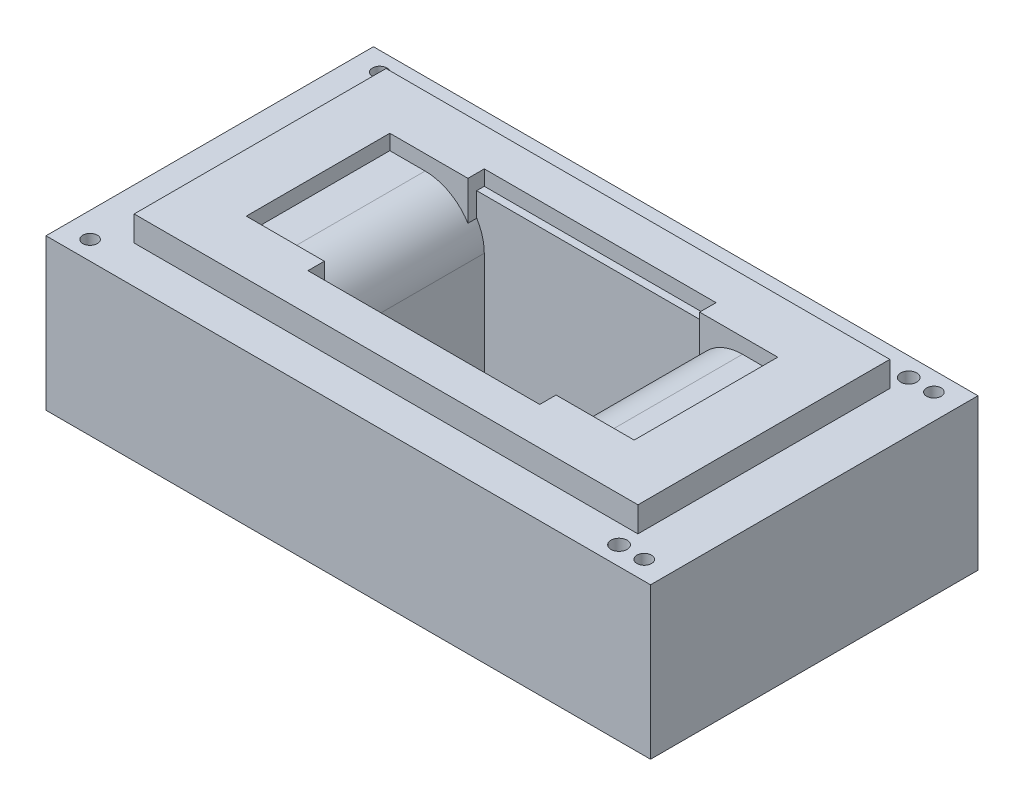
ISO-10303-21;
HEADER;
FILE_DESCRIPTION(('STEP AP214'),'2;1');
FILE_NAME('part.step','',(''),(''),'','','');
FILE_SCHEMA(('AUTOMOTIVE_DESIGN { 1 0 10303 214 1 1 1 1 }'));
ENDSEC;
DATA;
#1=APPLICATION_CONTEXT('core data for automotive mechanical design processes');
#2=APPLICATION_PROTOCOL_DEFINITION('international standard','automotive_design',2000,#1);
#3=PRODUCT_CONTEXT('',#1,'mechanical');
#4=PRODUCT('Part','Part','',(#3));
#5=PRODUCT_RELATED_PRODUCT_CATEGORY('part','',(#4));
#6=PRODUCT_DEFINITION_FORMATION('','',#4);
#7=PRODUCT_DEFINITION_CONTEXT('part definition',#1,'design');
#8=PRODUCT_DEFINITION('design','',#6,#7);
#9=PRODUCT_DEFINITION_SHAPE('','',#8);
#10=(LENGTH_UNIT() NAMED_UNIT(*) SI_UNIT(.MILLI.,.METRE.));
#11=(NAMED_UNIT(*) PLANE_ANGLE_UNIT() SI_UNIT($,.RADIAN.));
#12=(NAMED_UNIT(*) SI_UNIT($,.STERADIAN.) SOLID_ANGLE_UNIT());
#13=UNCERTAINTY_MEASURE_WITH_UNIT(LENGTH_MEASURE(1.E-05),#10,'distance_accuracy_value','');
#14=(GEOMETRIC_REPRESENTATION_CONTEXT(3) GLOBAL_UNCERTAINTY_ASSIGNED_CONTEXT((#13)) GLOBAL_UNIT_ASSIGNED_CONTEXT((#10,
#11,#12)) REPRESENTATION_CONTEXT('',''));
#15=CARTESIAN_POINT('',(0.,0.,0.));
#16=DIRECTION('',(0.,0.,1.));
#17=DIRECTION('',(1.,0.,0.));
#18=AXIS2_PLACEMENT_3D('',#15,#16,#17);
#19=CARTESIAN_POINT('',(0.,2.,0.));
#20=DIRECTION('',(0.,-1.,0.));
#21=DIRECTION('',(0.,0.,-1.));
#22=AXIS2_PLACEMENT_3D('',#19,#20,#21);
#23=PLANE('',#22);
#24=DIRECTION('',(-1.,0.,0.));
#25=VECTOR('',#24,1.);
#26=CARTESIAN_POINT('',(-21.5,2.,-16.));
#27=LINE('',#26,#25);
#28=CARTESIAN_POINT('',(23.,2.,-16.));
#29=VERTEX_POINT('',#28);
#30=CARTESIAN_POINT('',(-23.,2.,-16.));
#31=VERTEX_POINT('',#30);
#32=EDGE_CURVE('E258',#29,#31,#27,.T.);
#33=ORIENTED_EDGE('',*,*,#32,.F.);
#34=DIRECTION('',(0.,0.,1.));
#35=VECTOR('',#34,1.);
#36=CARTESIAN_POINT('',(23.,2.,-17.5));
#37=LINE('',#36,#35);
#38=CARTESIAN_POINT('',(23.,2.,-17.5));
#39=VERTEX_POINT('',#38);
#40=EDGE_CURVE('E440',#39,#29,#37,.T.);
#41=ORIENTED_EDGE('',*,*,#40,.F.);
#42=DIRECTION('',(1.,0.,0.));
#43=VECTOR('',#42,1.);
#44=CARTESIAN_POINT('',(-23.,2.,-17.5));
#45=LINE('',#44,#43);
#46=CARTESIAN_POINT('',(-23.,2.,-17.5));
#47=VERTEX_POINT('',#46);
#48=EDGE_CURVE('E437',#47,#39,#45,.T.);
#49=ORIENTED_EDGE('',*,*,#48,.F.);
#50=DIRECTION('',(0.,0.,1.));
#51=VECTOR('',#50,1.);
#52=CARTESIAN_POINT('',(-23.,2.,-17.5));
#53=LINE('',#52,#51);
#54=EDGE_CURVE('E434',#47,#31,#53,.T.);
#55=ORIENTED_EDGE('',*,*,#54,.T.);
#56=EDGE_LOOP('',(#33,#41,#49,#55));
#57=FACE_BOUND('',#56,.T.);
#58=ADVANCED_FACE('F39',(#57),#23,.F.);
#59=DIRECTION('',(1.,0.,0.));
#60=VECTOR('',#59,1.);
#61=CARTESIAN_POINT('',(23.,2.,-14.25));
#62=LINE('',#61,#60);
#63=CARTESIAN_POINT('',(31.5,2.,-14.25));
#64=VERTEX_POINT('',#63);
#65=CARTESIAN_POINT('',(38.5,2.,-14.25));
#66=VERTEX_POINT('',#65);
#67=EDGE_CURVE('E443',#64,#66,#62,.T.);
#68=ORIENTED_EDGE('',*,*,#67,.F.);
#69=DIRECTION('',(0.,0.,-1.));
#70=VECTOR('',#69,1.);
#71=CARTESIAN_POINT('',(31.5,2.,0.));
#72=LINE('',#71,#70);
#73=CARTESIAN_POINT('',(31.5,2.,14.25));
#74=VERTEX_POINT('',#73);
#75=EDGE_CURVE('E467',#64,#74,#72,.F.);
#76=ORIENTED_EDGE('',*,*,#75,.T.);
#77=DIRECTION('',(1.,0.,0.));
#78=VECTOR('',#77,1.);
#79=CARTESIAN_POINT('',(23.,2.,14.25));
#80=LINE('',#79,#78);
#81=CARTESIAN_POINT('',(38.5,2.,14.25));
#82=VERTEX_POINT('',#81);
#83=EDGE_CURVE('E448',#74,#82,#80,.T.);
#84=ORIENTED_EDGE('',*,*,#83,.T.);
#85=DIRECTION('',(0.,0.,1.));
#86=VECTOR('',#85,1.);
#87=CARTESIAN_POINT('',(38.5,2.,-14.25));
#88=LINE('',#87,#86);
#89=EDGE_CURVE('E445',#66,#82,#88,.T.);
#90=ORIENTED_EDGE('',*,*,#89,.F.);
#91=EDGE_LOOP('',(#68,#76,#84,#90));
#92=FACE_BOUND('',#91,.T.);
#93=ADVANCED_FACE('F564',(#92),#23,.F.);
#94=DIRECTION('',(0.,0.,1.));
#95=VECTOR('',#94,1.);
#96=CARTESIAN_POINT('',(23.,2.,14.25));
#97=LINE('',#96,#95);
#98=CARTESIAN_POINT('',(23.,2.,16.));
#99=VERTEX_POINT('',#98);
#100=CARTESIAN_POINT('',(23.,2.,17.5));
#101=VERTEX_POINT('',#100);
#102=EDGE_CURVE('E450',#99,#101,#97,.T.);
#103=ORIENTED_EDGE('',*,*,#102,.F.);
#104=DIRECTION('',(1.,0.,0.));
#105=VECTOR('',#104,1.);
#106=CARTESIAN_POINT('',(-21.5,2.,16.));
#107=LINE('',#106,#105);
#108=CARTESIAN_POINT('',(-23.,2.,16.));
#109=VERTEX_POINT('',#108);
#110=EDGE_CURVE('E264',#109,#99,#107,.T.);
#111=ORIENTED_EDGE('',*,*,#110,.F.);
#112=DIRECTION('',(0.,0.,1.));
#113=VECTOR('',#112,1.);
#114=CARTESIAN_POINT('',(-23.,2.,14.25));
#115=LINE('',#114,#113);
#116=CARTESIAN_POINT('',(-23.,2.,17.5));
#117=VERTEX_POINT('',#116);
#118=EDGE_CURVE('E455',#109,#117,#115,.T.);
#119=ORIENTED_EDGE('',*,*,#118,.T.);
#120=DIRECTION('',(1.,0.,0.));
#121=VECTOR('',#120,1.);
#122=CARTESIAN_POINT('',(-23.,2.,17.5));
#123=LINE('',#122,#121);
#124=EDGE_CURVE('E452',#117,#101,#123,.T.);
#125=ORIENTED_EDGE('',*,*,#124,.T.);
#126=EDGE_LOOP('',(#103,#111,#119,#125));
#127=FACE_BOUND('',#126,.T.);
#128=ADVANCED_FACE('F542',(#127),#23,.F.);
#129=DIRECTION('',(1.,0.,0.));
#130=VECTOR('',#129,1.);
#131=CARTESIAN_POINT('',(-38.5,2.,14.25));
#132=LINE('',#131,#130);
#133=CARTESIAN_POINT('',(-38.5,2.,14.25));
#134=VERTEX_POINT('',#133);
#135=CARTESIAN_POINT('',(-31.5,2.,14.25));
#136=VERTEX_POINT('',#135);
#137=EDGE_CURVE('E457',#134,#136,#132,.T.);
#138=ORIENTED_EDGE('',*,*,#137,.T.);
#139=DIRECTION('',(0.,0.,1.));
#140=VECTOR('',#139,1.);
#141=CARTESIAN_POINT('',(-31.5,2.,0.));
#142=LINE('',#141,#140);
#143=CARTESIAN_POINT('',(-31.5,2.,-14.25));
#144=VERTEX_POINT('',#143);
#145=EDGE_CURVE('E465',#136,#144,#142,.F.);
#146=ORIENTED_EDGE('',*,*,#145,.T.);
#147=DIRECTION('',(1.,0.,0.));
#148=VECTOR('',#147,1.);
#149=CARTESIAN_POINT('',(-38.5,2.,-14.25));
#150=LINE('',#149,#148);
#151=CARTESIAN_POINT('',(-38.5,2.,-14.25));
#152=VERTEX_POINT('',#151);
#153=EDGE_CURVE('E431',#152,#144,#150,.T.);
#154=ORIENTED_EDGE('',*,*,#153,.F.);
#155=DIRECTION('',(0.,0.,1.));
#156=VECTOR('',#155,1.);
#157=CARTESIAN_POINT('',(-38.5,2.,-14.25));
#158=LINE('',#157,#156);
#159=EDGE_CURVE('E460',#152,#134,#158,.T.);
#160=ORIENTED_EDGE('',*,*,#159,.T.);
#161=EDGE_LOOP('',(#138,#146,#154,#160));
#162=FACE_BOUND('',#161,.T.);
#163=ADVANCED_FACE('F516',(#162),#23,.F.);
#164=CARTESIAN_POINT('',(23.,5.,14.25));
#165=DIRECTION('',(0.,0.,-1.));
#166=DIRECTION('',(-1.,0.,0.));
#167=AXIS2_PLACEMENT_3D('',#164,#165,#166);
#168=PLANE('',#167);
#169=ORIENTED_EDGE('',*,*,#83,.F.);
#170=CARTESIAN_POINT('',(31.5,-8.,14.25));
#171=DIRECTION('',(0.,0.,-1.));
#172=DIRECTION('',(-1.,0.,0.));
#173=AXIS2_PLACEMENT_3D('',#170,#171,#172);
#174=CIRCLE('',#173,10.);
#175=CARTESIAN_POINT('',(23.,-2.73217312357362,14.25));
#176=VERTEX_POINT('',#175);
#177=EDGE_CURVE('E477',#74,#176,#174,.F.);
#178=ORIENTED_EDGE('',*,*,#177,.T.);
#179=DIRECTION('',(0.,-1.,0.));
#180=VECTOR('',#179,1.);
#181=CARTESIAN_POINT('',(23.,5.,14.25));
#182=LINE('',#181,#180);
#183=CARTESIAN_POINT('',(23.,5.,14.25));
#184=VERTEX_POINT('',#183);
#185=EDGE_CURVE('E366',#184,#176,#182,.T.);
#186=ORIENTED_EDGE('',*,*,#185,.F.);
#187=DIRECTION('',(1.,0.,0.));
#188=VECTOR('',#187,1.);
#189=CARTESIAN_POINT('',(23.,5.,14.25));
#190=LINE('',#189,#188);
#191=CARTESIAN_POINT('',(38.5,5.,14.25));
#192=VERTEX_POINT('',#191);
#193=EDGE_CURVE('E341',#184,#192,#190,.T.);
#194=ORIENTED_EDGE('',*,*,#193,.T.);
#195=DIRECTION('',(0.,-1.,0.));
#196=VECTOR('',#195,1.);
#197=CARTESIAN_POINT('',(38.5,5.,14.25));
#198=LINE('',#197,#196);
#199=EDGE_CURVE('E395',#192,#82,#198,.T.);
#200=ORIENTED_EDGE('',*,*,#199,.T.);
#201=EDGE_LOOP('',(#169,#178,#186,#194,#200));
#202=FACE_BOUND('',#201,.T.);
#203=ADVANCED_FACE('F548',(#202),#168,.T.);
#204=CARTESIAN_POINT('',(38.5,5.,-14.25));
#205=DIRECTION('',(-1.,0.,0.));
#206=DIRECTION('',(0.,0.,1.));
#207=AXIS2_PLACEMENT_3D('',#204,#205,#206);
#208=PLANE('',#207);
#209=ORIENTED_EDGE('',*,*,#89,.T.);
#210=ORIENTED_EDGE('',*,*,#199,.F.);
#211=DIRECTION('',(0.,0.,-1.));
#212=VECTOR('',#211,1.);
#213=CARTESIAN_POINT('',(38.5,5.,-14.25));
#214=LINE('',#213,#212);
#215=CARTESIAN_POINT('',(38.5,5.,-14.25));
#216=VERTEX_POINT('',#215);
#217=EDGE_CURVE('E343',#192,#216,#214,.T.);
#218=ORIENTED_EDGE('',*,*,#217,.T.);
#219=DIRECTION('',(0.,-1.,0.));
#220=VECTOR('',#219,1.);
#221=CARTESIAN_POINT('',(38.5,5.,-14.25));
#222=LINE('',#221,#220);
#223=EDGE_CURVE('E392',#216,#66,#222,.T.);
#224=ORIENTED_EDGE('',*,*,#223,.T.);
#225=EDGE_LOOP('',(#209,#210,#218,#224));
#226=FACE_BOUND('',#225,.T.);
#227=ADVANCED_FACE('F555',(#226),#208,.T.);
#228=CARTESIAN_POINT('',(23.,5.,-14.25));
#229=DIRECTION('',(0.,0.,1.));
#230=DIRECTION('',(1.,0.,0.));
#231=AXIS2_PLACEMENT_3D('',#228,#229,#230);
#232=PLANE('',#231);
#233=DIRECTION('',(0.,-1.,0.));
#234=VECTOR('',#233,1.);
#235=CARTESIAN_POINT('',(23.,5.,-14.25));
#236=LINE('',#235,#234);
#237=CARTESIAN_POINT('',(23.,5.,-14.25));
#238=VERTEX_POINT('',#237);
#239=CARTESIAN_POINT('',(23.,-2.73217312357363,-14.25));
#240=VERTEX_POINT('',#239);
#241=EDGE_CURVE('E390',#238,#240,#236,.T.);
#242=ORIENTED_EDGE('',*,*,#241,.T.);
#243=CARTESIAN_POINT('',(31.5,-8.,-14.25));
#244=DIRECTION('',(0.,0.,1.));
#245=DIRECTION('',(1.,0.,0.));
#246=AXIS2_PLACEMENT_3D('',#243,#244,#245);
#247=CIRCLE('',#246,10.);
#248=EDGE_CURVE('E475',#240,#64,#247,.F.);
#249=ORIENTED_EDGE('',*,*,#248,.T.);
#250=ORIENTED_EDGE('',*,*,#67,.T.);
#251=ORIENTED_EDGE('',*,*,#223,.F.);
#252=DIRECTION('',(-1.,0.,0.));
#253=VECTOR('',#252,1.);
#254=CARTESIAN_POINT('',(23.,5.,-14.25));
#255=LINE('',#254,#253);
#256=EDGE_CURVE('E345',#216,#238,#255,.T.);
#257=ORIENTED_EDGE('',*,*,#256,.T.);
#258=EDGE_LOOP('',(#242,#249,#250,#251,#257));
#259=FACE_BOUND('',#258,.T.);
#260=ADVANCED_FACE('F557',(#259),#232,.T.);
#261=CARTESIAN_POINT('',(23.,5.,-17.5));
#262=DIRECTION('',(-1.,0.,0.));
#263=DIRECTION('',(0.,0.,1.));
#264=AXIS2_PLACEMENT_3D('',#261,#262,#263);
#265=PLANE('',#264);
#266=ORIENTED_EDGE('',*,*,#40,.T.);
#267=DIRECTION('',(0.,-1.,0.));
#268=VECTOR('',#267,1.);
#269=CARTESIAN_POINT('',(23.,5.,-16.));
#270=LINE('',#269,#268);
#271=CARTESIAN_POINT('',(23.,-2.73217312357363,-16.));
#272=VERTEX_POINT('',#271);
#273=EDGE_CURVE('E496',#29,#272,#270,.T.);
#274=ORIENTED_EDGE('',*,*,#273,.T.);
#275=DIRECTION('',(0.,0.,-1.));
#276=VECTOR('',#275,1.);
#277=CARTESIAN_POINT('',(23.,-2.73217312357363,-16.));
#278=LINE('',#277,#276);
#279=EDGE_CURVE('E472',#272,#240,#278,.F.);
#280=ORIENTED_EDGE('',*,*,#279,.T.);
#281=ORIENTED_EDGE('',*,*,#241,.F.);
#282=DIRECTION('',(0.,0.,-1.));
#283=VECTOR('',#282,1.);
#284=CARTESIAN_POINT('',(23.,5.,-17.5));
#285=LINE('',#284,#283);
#286=CARTESIAN_POINT('',(23.,5.,-17.5));
#287=VERTEX_POINT('',#286);
#288=EDGE_CURVE('E347',#238,#287,#285,.T.);
#289=ORIENTED_EDGE('',*,*,#288,.T.);
#290=DIRECTION('',(0.,-1.,0.));
#291=VECTOR('',#290,1.);
#292=CARTESIAN_POINT('',(23.,5.,-17.5));
#293=LINE('',#292,#291);
#294=EDGE_CURVE('E387',#287,#39,#293,.T.);
#295=ORIENTED_EDGE('',*,*,#294,.T.);
#296=EDGE_LOOP('',(#266,#274,#280,#281,#289,#295));
#297=FACE_BOUND('',#296,.T.);
#298=ADVANCED_FACE('F583',(#297),#265,.T.);
#299=CARTESIAN_POINT('',(-23.,5.,-17.5));
#300=DIRECTION('',(0.,0.,1.));
#301=DIRECTION('',(1.,0.,0.));
#302=AXIS2_PLACEMENT_3D('',#299,#300,#301);
#303=PLANE('',#302);
#304=ORIENTED_EDGE('',*,*,#48,.T.);
#305=ORIENTED_EDGE('',*,*,#294,.F.);
#306=DIRECTION('',(-1.,0.,0.));
#307=VECTOR('',#306,1.);
#308=CARTESIAN_POINT('',(-23.,5.,-17.5));
#309=LINE('',#308,#307);
#310=CARTESIAN_POINT('',(-23.,5.,-17.5));
#311=VERTEX_POINT('',#310);
#312=EDGE_CURVE('E349',#287,#311,#309,.T.);
#313=ORIENTED_EDGE('',*,*,#312,.T.);
#314=DIRECTION('',(0.,-1.,0.));
#315=VECTOR('',#314,1.);
#316=CARTESIAN_POINT('',(-23.,5.,-17.5));
#317=LINE('',#316,#315);
#318=EDGE_CURVE('E384',#311,#47,#317,.T.);
#319=ORIENTED_EDGE('',*,*,#318,.T.);
#320=EDGE_LOOP('',(#304,#305,#313,#319));
#321=FACE_BOUND('',#320,.T.);
#322=ADVANCED_FACE('F581',(#321),#303,.T.);
#323=CARTESIAN_POINT('',(-23.,5.,-17.5));
#324=DIRECTION('',(1.,0.,0.));
#325=DIRECTION('',(0.,0.,-1.));
#326=AXIS2_PLACEMENT_3D('',#323,#324,#325);
#327=PLANE('',#326);
#328=ORIENTED_EDGE('',*,*,#54,.F.);
#329=ORIENTED_EDGE('',*,*,#318,.F.);
#330=DIRECTION('',(0.,0.,1.));
#331=VECTOR('',#330,1.);
#332=CARTESIAN_POINT('',(-23.,5.,-17.5));
#333=LINE('',#332,#331);
#334=CARTESIAN_POINT('',(-23.,5.,-14.25));
#335=VERTEX_POINT('',#334);
#336=EDGE_CURVE('E351',#311,#335,#333,.T.);
#337=ORIENTED_EDGE('',*,*,#336,.T.);
#338=DIRECTION('',(0.,-1.,0.));
#339=VECTOR('',#338,1.);
#340=CARTESIAN_POINT('',(-23.,5.,-14.25));
#341=LINE('',#340,#339);
#342=CARTESIAN_POINT('',(-23.,-2.73217312357364,-14.25));
#343=VERTEX_POINT('',#342);
#344=EDGE_CURVE('E382',#335,#343,#341,.T.);
#345=ORIENTED_EDGE('',*,*,#344,.T.);
#346=DIRECTION('',(0.,0.,1.));
#347=VECTOR('',#346,1.);
#348=CARTESIAN_POINT('',(-23.,-2.73217312357364,-16.));
#349=LINE('',#348,#347);
#350=CARTESIAN_POINT('',(-23.,-2.73217312357364,-16.));
#351=VERTEX_POINT('',#350);
#352=EDGE_CURVE('E54',#343,#351,#349,.F.);
#353=ORIENTED_EDGE('',*,*,#352,.T.);
#354=DIRECTION('',(0.,1.,0.));
#355=VECTOR('',#354,1.);
#356=CARTESIAN_POINT('',(-23.,5.,-16.));
#357=LINE('',#356,#355);
#358=EDGE_CURVE('E11',#31,#351,#357,.F.);
#359=ORIENTED_EDGE('',*,*,#358,.F.);
#360=EDGE_LOOP('',(#328,#329,#337,#345,#353,#359));
#361=FACE_BOUND('',#360,.T.);
#362=ADVANCED_FACE('F576',(#361),#327,.T.);
#363=CARTESIAN_POINT('',(-38.5,5.,-14.25));
#364=DIRECTION('',(0.,0.,1.));
#365=DIRECTION('',(1.,0.,0.));
#366=AXIS2_PLACEMENT_3D('',#363,#364,#365);
#367=PLANE('',#366);
#368=ORIENTED_EDGE('',*,*,#153,.T.);
#369=CARTESIAN_POINT('',(-31.5,-8.,-14.25));
#370=DIRECTION('',(0.,0.,1.));
#371=DIRECTION('',(1.,0.,0.));
#372=AXIS2_PLACEMENT_3D('',#369,#370,#371);
#373=CIRCLE('',#372,10.);
#374=EDGE_CURVE('E490',#144,#343,#373,.F.);
#375=ORIENTED_EDGE('',*,*,#374,.T.);
#376=ORIENTED_EDGE('',*,*,#344,.F.);
#377=DIRECTION('',(-1.,0.,0.));
#378=VECTOR('',#377,1.);
#379=CARTESIAN_POINT('',(-38.5,5.,-14.25));
#380=LINE('',#379,#378);
#381=CARTESIAN_POINT('',(-38.5,5.,-14.25));
#382=VERTEX_POINT('',#381);
#383=EDGE_CURVE('E353',#335,#382,#380,.T.);
#384=ORIENTED_EDGE('',*,*,#383,.T.);
#385=DIRECTION('',(0.,-1.,0.));
#386=VECTOR('',#385,1.);
#387=CARTESIAN_POINT('',(-38.5,5.,-14.25));
#388=LINE('',#387,#386);
#389=EDGE_CURVE('E379',#382,#152,#388,.T.);
#390=ORIENTED_EDGE('',*,*,#389,.T.);
#391=EDGE_LOOP('',(#368,#375,#376,#384,#390));
#392=FACE_BOUND('',#391,.T.);
#393=ADVANCED_FACE('F523',(#392),#367,.T.);
#394=CARTESIAN_POINT('',(-38.5,5.,-14.25));
#395=DIRECTION('',(1.,0.,0.));
#396=DIRECTION('',(0.,0.,-1.));
#397=AXIS2_PLACEMENT_3D('',#394,#395,#396);
#398=PLANE('',#397);
#399=ORIENTED_EDGE('',*,*,#159,.F.);
#400=ORIENTED_EDGE('',*,*,#389,.F.);
#401=DIRECTION('',(0.,0.,1.));
#402=VECTOR('',#401,1.);
#403=CARTESIAN_POINT('',(-38.5,5.,-14.25));
#404=LINE('',#403,#402);
#405=CARTESIAN_POINT('',(-38.5,5.,14.25));
#406=VERTEX_POINT('',#405);
#407=EDGE_CURVE('E355',#382,#406,#404,.T.);
#408=ORIENTED_EDGE('',*,*,#407,.T.);
#409=DIRECTION('',(0.,-1.,0.));
#410=VECTOR('',#409,1.);
#411=CARTESIAN_POINT('',(-38.5,5.,14.25));
#412=LINE('',#411,#410);
#413=EDGE_CURVE('E376',#406,#134,#412,.T.);
#414=ORIENTED_EDGE('',*,*,#413,.T.);
#415=EDGE_LOOP('',(#399,#400,#408,#414));
#416=FACE_BOUND('',#415,.T.);
#417=ADVANCED_FACE('F520',(#416),#398,.T.);
#418=CARTESIAN_POINT('',(-38.5,5.,14.25));
#419=DIRECTION('',(0.,0.,-1.));
#420=DIRECTION('',(-1.,0.,0.));
#421=AXIS2_PLACEMENT_3D('',#418,#419,#420);
#422=PLANE('',#421);
#423=ORIENTED_EDGE('',*,*,#137,.F.);
#424=ORIENTED_EDGE('',*,*,#413,.F.);
#425=DIRECTION('',(1.,0.,0.));
#426=VECTOR('',#425,1.);
#427=CARTESIAN_POINT('',(-38.5,5.,14.25));
#428=LINE('',#427,#426);
#429=CARTESIAN_POINT('',(-23.,5.,14.25));
#430=VERTEX_POINT('',#429);
#431=EDGE_CURVE('E357',#406,#430,#428,.T.);
#432=ORIENTED_EDGE('',*,*,#431,.T.);
#433=DIRECTION('',(0.,-1.,0.));
#434=VECTOR('',#433,1.);
#435=CARTESIAN_POINT('',(-23.,5.,14.25));
#436=LINE('',#435,#434);
#437=CARTESIAN_POINT('',(-23.,-2.73217312357364,14.25));
#438=VERTEX_POINT('',#437);
#439=EDGE_CURVE('E374',#430,#438,#436,.T.);
#440=ORIENTED_EDGE('',*,*,#439,.T.);
#441=CARTESIAN_POINT('',(-31.5,-8.,14.25));
#442=DIRECTION('',(0.,0.,-1.));
#443=DIRECTION('',(-1.,0.,0.));
#444=AXIS2_PLACEMENT_3D('',#441,#442,#443);
#445=CIRCLE('',#444,10.);
#446=EDGE_CURVE('E488',#438,#136,#445,.F.);
#447=ORIENTED_EDGE('',*,*,#446,.T.);
#448=EDGE_LOOP('',(#423,#424,#432,#440,#447));
#449=FACE_BOUND('',#448,.T.);
#450=ADVANCED_FACE('F513',(#449),#422,.T.);
#451=CARTESIAN_POINT('',(-23.,5.,14.25));
#452=DIRECTION('',(1.,0.,0.));
#453=DIRECTION('',(0.,0.,-1.));
#454=AXIS2_PLACEMENT_3D('',#451,#452,#453);
#455=PLANE('',#454);
#456=ORIENTED_EDGE('',*,*,#118,.F.);
#457=DIRECTION('',(0.,-1.,0.));
#458=VECTOR('',#457,1.);
#459=CARTESIAN_POINT('',(-23.,5.,16.));
#460=LINE('',#459,#458);
#461=CARTESIAN_POINT('',(-23.,-2.73217312357364,16.));
#462=VERTEX_POINT('',#461);
#463=EDGE_CURVE('E499',#109,#462,#460,.T.);
#464=ORIENTED_EDGE('',*,*,#463,.T.);
#465=DIRECTION('',(0.,0.,1.));
#466=VECTOR('',#465,1.);
#467=CARTESIAN_POINT('',(-23.,-2.73217312357364,-16.));
#468=LINE('',#467,#466);
#469=EDGE_CURVE('E485',#462,#438,#468,.F.);
#470=ORIENTED_EDGE('',*,*,#469,.T.);
#471=ORIENTED_EDGE('',*,*,#439,.F.);
#472=DIRECTION('',(0.,0.,1.));
#473=VECTOR('',#472,1.);
#474=CARTESIAN_POINT('',(-23.,5.,14.25));
#475=LINE('',#474,#473);
#476=CARTESIAN_POINT('',(-23.,5.,17.5));
#477=VERTEX_POINT('',#476);
#478=EDGE_CURVE('E359',#430,#477,#475,.T.);
#479=ORIENTED_EDGE('',*,*,#478,.T.);
#480=DIRECTION('',(0.,-1.,0.));
#481=VECTOR('',#480,1.);
#482=CARTESIAN_POINT('',(-23.,5.,17.5));
#483=LINE('',#482,#481);
#484=EDGE_CURVE('E371',#477,#117,#483,.T.);
#485=ORIENTED_EDGE('',*,*,#484,.T.);
#486=EDGE_LOOP('',(#456,#464,#470,#471,#479,#485));
#487=FACE_BOUND('',#486,.T.);
#488=ADVANCED_FACE('F505',(#487),#455,.T.);
#489=CARTESIAN_POINT('',(-23.,5.,17.5));
#490=DIRECTION('',(0.,0.,-1.));
#491=DIRECTION('',(-1.,0.,0.));
#492=AXIS2_PLACEMENT_3D('',#489,#490,#491);
#493=PLANE('',#492);
#494=ORIENTED_EDGE('',*,*,#124,.F.);
#495=ORIENTED_EDGE('',*,*,#484,.F.);
#496=DIRECTION('',(1.,0.,0.));
#497=VECTOR('',#496,1.);
#498=CARTESIAN_POINT('',(-23.,5.,17.5));
#499=LINE('',#498,#497);
#500=CARTESIAN_POINT('',(23.,5.,17.5));
#501=VERTEX_POINT('',#500);
#502=EDGE_CURVE('E361',#477,#501,#499,.T.);
#503=ORIENTED_EDGE('',*,*,#502,.T.);
#504=DIRECTION('',(0.,-1.,0.));
#505=VECTOR('',#504,1.);
#506=CARTESIAN_POINT('',(23.,5.,17.5));
#507=LINE('',#506,#505);
#508=EDGE_CURVE('E368',#501,#101,#507,.T.);
#509=ORIENTED_EDGE('',*,*,#508,.T.);
#510=EDGE_LOOP('',(#494,#495,#503,#509));
#511=FACE_BOUND('',#510,.T.);
#512=ADVANCED_FACE('F539',(#511),#493,.T.);
#513=CARTESIAN_POINT('',(23.,5.,14.25));
#514=DIRECTION('',(-1.,0.,0.));
#515=DIRECTION('',(0.,0.,1.));
#516=AXIS2_PLACEMENT_3D('',#513,#514,#515);
#517=PLANE('',#516);
#518=ORIENTED_EDGE('',*,*,#185,.T.);
#519=DIRECTION('',(0.,0.,-1.));
#520=VECTOR('',#519,1.);
#521=CARTESIAN_POINT('',(23.0000000000001,-2.73217312357351,-16.));
#522=LINE('',#521,#520);
#523=CARTESIAN_POINT('',(23.0000000000001,-2.73217312357351,16.));
#524=VERTEX_POINT('',#523);
#525=EDGE_CURVE('E61',#176,#524,#522,.F.);
#526=ORIENTED_EDGE('',*,*,#525,.T.);
#527=DIRECTION('',(0.,1.,0.));
#528=VECTOR('',#527,1.);
#529=CARTESIAN_POINT('',(23.,5.,16.));
#530=LINE('',#529,#528);
#531=EDGE_CURVE('E47',#99,#524,#530,.F.);
#532=ORIENTED_EDGE('',*,*,#531,.F.);
#533=ORIENTED_EDGE('',*,*,#102,.T.);
#534=ORIENTED_EDGE('',*,*,#508,.F.);
#535=DIRECTION('',(0.,0.,-1.));
#536=VECTOR('',#535,1.);
#537=CARTESIAN_POINT('',(23.,5.,14.25));
#538=LINE('',#537,#536);
#539=EDGE_CURVE('E364',#501,#184,#538,.T.);
#540=ORIENTED_EDGE('',*,*,#539,.T.);
#541=EDGE_LOOP('',(#518,#526,#532,#533,#534,#540));
#542=FACE_BOUND('',#541,.T.);
#543=ADVANCED_FACE('F544',(#542),#517,.T.);
#544=CARTESIAN_POINT('',(0.,5.,0.));
#545=DIRECTION('',(0.,1.,0.));
#546=DIRECTION('',(0.,0.,1.));
#547=AXIS2_PLACEMENT_3D('',#544,#545,#546);
#548=PLANE('',#547);
#549=DIRECTION('',(0.,0.,-1.));
#550=VECTOR('',#549,1.);
#551=CARTESIAN_POINT('',(50.,5.,-25.));
#552=LINE('',#551,#550);
#553=CARTESIAN_POINT('',(50.,5.,25.));
#554=VERTEX_POINT('',#553);
#555=CARTESIAN_POINT('',(50.,5.,-25.));
#556=VERTEX_POINT('',#555);
#557=EDGE_CURVE('E399',#554,#556,#552,.T.);
#558=ORIENTED_EDGE('',*,*,#557,.T.);
#559=DIRECTION('',(-1.,0.,0.));
#560=VECTOR('',#559,1.);
#561=CARTESIAN_POINT('',(-50.,5.,-25.));
#562=LINE('',#561,#560);
#563=CARTESIAN_POINT('',(-50.,5.,-25.));
#564=VERTEX_POINT('',#563);
#565=EDGE_CURVE('E402',#556,#564,#562,.T.);
#566=ORIENTED_EDGE('',*,*,#565,.T.);
#567=DIRECTION('',(0.,0.,1.));
#568=VECTOR('',#567,1.);
#569=CARTESIAN_POINT('',(-50.,5.,-25.));
#570=LINE('',#569,#568);
#571=CARTESIAN_POINT('',(-50.,5.,25.));
#572=VERTEX_POINT('',#571);
#573=EDGE_CURVE('E405',#564,#572,#570,.T.);
#574=ORIENTED_EDGE('',*,*,#573,.T.);
#575=DIRECTION('',(1.,0.,0.));
#576=VECTOR('',#575,1.);
#577=CARTESIAN_POINT('',(-50.,5.,25.));
#578=LINE('',#577,#576);
#579=EDGE_CURVE('E407',#572,#554,#578,.T.);
#580=ORIENTED_EDGE('',*,*,#579,.T.);
#581=EDGE_LOOP('',(#558,#566,#574,#580));
#582=FACE_BOUND('',#581,.T.);
#583=ORIENTED_EDGE('',*,*,#217,.F.);
#584=ORIENTED_EDGE('',*,*,#193,.F.);
#585=ORIENTED_EDGE('',*,*,#539,.F.);
#586=ORIENTED_EDGE('',*,*,#502,.F.);
#587=ORIENTED_EDGE('',*,*,#478,.F.);
#588=ORIENTED_EDGE('',*,*,#431,.F.);
#589=ORIENTED_EDGE('',*,*,#407,.F.);
#590=ORIENTED_EDGE('',*,*,#383,.F.);
#591=ORIENTED_EDGE('',*,*,#336,.F.);
#592=ORIENTED_EDGE('',*,*,#312,.F.);
#593=ORIENTED_EDGE('',*,*,#288,.F.);
#594=ORIENTED_EDGE('',*,*,#256,.F.);
#595=EDGE_LOOP('',(#583,#584,#585,#586,#587,#588,#589,#590,#591,#592,#593,#594));
#596=FACE_BOUND('',#595,.T.);
#597=ADVANCED_FACE('F529',(#582,#596),#548,.T.);
#598=CARTESIAN_POINT('',(50.,5.,-25.));
#599=DIRECTION('',(-1.,0.,0.));
#600=DIRECTION('',(0.,0.,1.));
#601=AXIS2_PLACEMENT_3D('',#598,#599,#600);
#602=PLANE('',#601);
#603=DIRECTION('',(0.,0.,-1.));
#604=VECTOR('',#603,1.);
#605=CARTESIAN_POINT('',(50.,0.,-25.));
#606=LINE('',#605,#604);
#607=CARTESIAN_POINT('',(50.,0.,25.));
#608=VERTEX_POINT('',#607);
#609=CARTESIAN_POINT('',(50.,0.,-25.));
#610=VERTEX_POINT('',#609);
#611=EDGE_CURVE('E398',#608,#610,#606,.T.);
#612=ORIENTED_EDGE('',*,*,#611,.T.);
#613=DIRECTION('',(0.,-1.,0.));
#614=VECTOR('',#613,1.);
#615=CARTESIAN_POINT('',(50.,5.,-25.));
#616=LINE('',#615,#614);
#617=EDGE_CURVE('E428',#556,#610,#616,.T.);
#618=ORIENTED_EDGE('',*,*,#617,.F.);
#619=ORIENTED_EDGE('',*,*,#557,.F.);
#620=DIRECTION('',(0.,-1.,0.));
#621=VECTOR('',#620,1.);
#622=CARTESIAN_POINT('',(50.,5.,25.));
#623=LINE('',#622,#621);
#624=EDGE_CURVE('E409',#554,#608,#623,.T.);
#625=ORIENTED_EDGE('',*,*,#624,.T.);
#626=EDGE_LOOP('',(#612,#618,#619,#625));
#627=FACE_BOUND('',#626,.T.);
#628=ADVANCED_FACE('F782',(#627),#602,.F.);
#629=CARTESIAN_POINT('',(-50.,5.,-25.));
#630=DIRECTION('',(0.,0.,1.));
#631=DIRECTION('',(1.,0.,0.));
#632=AXIS2_PLACEMENT_3D('',#629,#630,#631);
#633=PLANE('',#632);
#634=DIRECTION('',(-1.,0.,0.));
#635=VECTOR('',#634,1.);
#636=CARTESIAN_POINT('',(-50.,0.,-25.));
#637=LINE('',#636,#635);
#638=CARTESIAN_POINT('',(-50.,0.,-25.));
#639=VERTEX_POINT('',#638);
#640=EDGE_CURVE('E412',#610,#639,#637,.T.);
#641=ORIENTED_EDGE('',*,*,#640,.T.);
#642=DIRECTION('',(0.,-1.,0.));
#643=VECTOR('',#642,1.);
#644=CARTESIAN_POINT('',(-50.,5.,-25.));
#645=LINE('',#644,#643);
#646=EDGE_CURVE('E425',#564,#639,#645,.T.);
#647=ORIENTED_EDGE('',*,*,#646,.F.);
#648=ORIENTED_EDGE('',*,*,#565,.F.);
#649=ORIENTED_EDGE('',*,*,#617,.T.);
#650=EDGE_LOOP('',(#641,#647,#648,#649));
#651=FACE_BOUND('',#650,.T.);
#652=ADVANCED_FACE('F771',(#651),#633,.F.);
#653=CARTESIAN_POINT('',(-50.,5.,-25.));
#654=DIRECTION('',(1.,0.,0.));
#655=DIRECTION('',(0.,0.,-1.));
#656=AXIS2_PLACEMENT_3D('',#653,#654,#655);
#657=PLANE('',#656);
#658=DIRECTION('',(0.,0.,1.));
#659=VECTOR('',#658,1.);
#660=CARTESIAN_POINT('',(-50.,0.,-25.));
#661=LINE('',#660,#659);
#662=CARTESIAN_POINT('',(-50.,0.,25.));
#663=VERTEX_POINT('',#662);
#664=EDGE_CURVE('E415',#639,#663,#661,.T.);
#665=ORIENTED_EDGE('',*,*,#664,.T.);
#666=DIRECTION('',(0.,-1.,0.));
#667=VECTOR('',#666,1.);
#668=CARTESIAN_POINT('',(-50.,5.,25.));
#669=LINE('',#668,#667);
#670=EDGE_CURVE('E422',#572,#663,#669,.T.);
#671=ORIENTED_EDGE('',*,*,#670,.F.);
#672=ORIENTED_EDGE('',*,*,#573,.F.);
#673=ORIENTED_EDGE('',*,*,#646,.T.);
#674=EDGE_LOOP('',(#665,#671,#672,#673));
#675=FACE_BOUND('',#674,.T.);
#676=ADVANCED_FACE('F760',(#675),#657,.F.);
#677=CARTESIAN_POINT('',(-50.,5.,25.));
#678=DIRECTION('',(0.,0.,-1.));
#679=DIRECTION('',(-1.,0.,0.));
#680=AXIS2_PLACEMENT_3D('',#677,#678,#679);
#681=PLANE('',#680);
#682=DIRECTION('',(1.,0.,0.));
#683=VECTOR('',#682,1.);
#684=CARTESIAN_POINT('',(-50.,0.,25.));
#685=LINE('',#684,#683);
#686=EDGE_CURVE('E403',#663,#608,#685,.T.);
#687=ORIENTED_EDGE('',*,*,#686,.T.);
#688=ORIENTED_EDGE('',*,*,#624,.F.);
#689=ORIENTED_EDGE('',*,*,#579,.F.);
#690=ORIENTED_EDGE('',*,*,#670,.T.);
#691=EDGE_LOOP('',(#687,#688,#689,#690));
#692=FACE_BOUND('',#691,.T.);
#693=ADVANCED_FACE('F628',(#692),#681,.F.);
#694=CARTESIAN_POINT('',(0.,-30.,0.));
#695=DIRECTION('',(0.,-1.,0.));
#696=DIRECTION('',(0.,0.,-1.));
#697=AXIS2_PLACEMENT_3D('',#694,#695,#696);
#698=PLANE('',#697);
#699=DIRECTION('',(0.,0.,1.));
#700=VECTOR('',#699,1.);
#701=CARTESIAN_POINT('',(-21.5,-30.,-16.));
#702=LINE('',#701,#700);
#703=CARTESIAN_POINT('',(-21.5,-30.,-16.));
#704=VERTEX_POINT('',#703);
#705=CARTESIAN_POINT('',(-21.5,-30.,16.));
#706=VERTEX_POINT('',#705);
#707=EDGE_CURVE('E254',#704,#706,#702,.T.);
#708=ORIENTED_EDGE('',*,*,#707,.T.);
#709=DIRECTION('',(1.,0.,0.));
#710=VECTOR('',#709,1.);
#711=CARTESIAN_POINT('',(-21.5,-30.,16.));
#712=LINE('',#711,#710);
#713=CARTESIAN_POINT('',(21.5,-30.,16.));
#714=VERTEX_POINT('',#713);
#715=EDGE_CURVE('E237',#706,#714,#712,.T.);
#716=ORIENTED_EDGE('',*,*,#715,.T.);
#717=DIRECTION('',(0.,0.,-1.));
#718=VECTOR('',#717,1.);
#719=CARTESIAN_POINT('',(21.5,-30.,-16.));
#720=LINE('',#719,#718);
#721=CARTESIAN_POINT('',(21.5,-30.,-16.));
#722=VERTEX_POINT('',#721);
#723=EDGE_CURVE('E267',#714,#722,#720,.T.);
#724=ORIENTED_EDGE('',*,*,#723,.T.);
#725=DIRECTION('',(-1.,0.,0.));
#726=VECTOR('',#725,1.);
#727=CARTESIAN_POINT('',(-21.5,-30.,-16.));
#728=LINE('',#727,#726);
#729=EDGE_CURVE('E263',#722,#704,#728,.T.);
#730=ORIENTED_EDGE('',*,*,#729,.T.);
#731=EDGE_LOOP('',(#708,#716,#724,#730));
#732=FACE_BOUND('',#731,.T.);
#733=CARTESIAN_POINT('',(-55.,-30.,-28.75));
#734=DIRECTION('',(0.,-1.,0.));
#735=DIRECTION('',(0.,0.,1.));
#736=AXIS2_PLACEMENT_3D('',#733,#734,#735);
#737=CIRCLE('',#736,1.45);
#738=CARTESIAN_POINT('',(-55.,-30.,-27.3));
#739=VERTEX_POINT('',#738);
#740=EDGE_CURVE('E283',#739,#739,#737,.T.);
#741=ORIENTED_EDGE('',*,*,#740,.F.);
#742=EDGE_LOOP('',(#741));
#743=FACE_BOUND('',#742,.T.);
#744=CARTESIAN_POINT('',(55.,-30.,28.75));
#745=DIRECTION('',(0.,-1.,0.));
#746=DIRECTION('',(0.,0.,1.));
#747=AXIS2_PLACEMENT_3D('',#744,#745,#746);
#748=CIRCLE('',#747,1.45);
#749=CARTESIAN_POINT('',(55.,-30.,30.2));
#750=VERTEX_POINT('',#749);
#751=EDGE_CURVE('E295',#750,#750,#748,.T.);
#752=ORIENTED_EDGE('',*,*,#751,.F.);
#753=EDGE_LOOP('',(#752));
#754=FACE_BOUND('',#753,.T.);
#755=CARTESIAN_POINT('',(-55.,-30.,28.75));
#756=DIRECTION('',(0.,-1.,0.));
#757=DIRECTION('',(0.,0.,-1.));
#758=AXIS2_PLACEMENT_3D('',#755,#756,#757);
#759=CIRCLE('',#758,1.45);
#760=CARTESIAN_POINT('',(-55.,-30.,27.3));
#761=VERTEX_POINT('',#760);
#762=EDGE_CURVE('E307',#761,#761,#759,.T.);
#763=ORIENTED_EDGE('',*,*,#762,.F.);
#764=EDGE_LOOP('',(#763));
#765=FACE_BOUND('',#764,.T.);
#766=DIRECTION('',(0.,0.,1.));
#767=VECTOR('',#766,1.);
#768=CARTESIAN_POINT('',(60.,-30.,32.5));
#769=LINE('',#768,#767);
#770=CARTESIAN_POINT('',(60.,-30.,-32.5));
#771=VERTEX_POINT('',#770);
#772=CARTESIAN_POINT('',(60.,-30.,32.5));
#773=VERTEX_POINT('',#772);
#774=EDGE_CURVE('E313',#771,#773,#769,.T.);
#775=ORIENTED_EDGE('',*,*,#774,.T.);
#776=DIRECTION('',(-1.,0.,0.));
#777=VECTOR('',#776,1.);
#778=CARTESIAN_POINT('',(-60.,-30.,32.5));
#779=LINE('',#778,#777);
#780=CARTESIAN_POINT('',(-60.,-30.,32.5));
#781=VERTEX_POINT('',#780);
#782=EDGE_CURVE('E316',#773,#781,#779,.T.);
#783=ORIENTED_EDGE('',*,*,#782,.T.);
#784=DIRECTION('',(0.,0.,-1.));
#785=VECTOR('',#784,1.);
#786=CARTESIAN_POINT('',(-60.,-30.,32.5));
#787=LINE('',#786,#785);
#788=CARTESIAN_POINT('',(-60.,-30.,-32.5));
#789=VERTEX_POINT('',#788);
#790=EDGE_CURVE('E319',#781,#789,#787,.T.);
#791=ORIENTED_EDGE('',*,*,#790,.T.);
#792=DIRECTION('',(1.,0.,0.));
#793=VECTOR('',#792,1.);
#794=CARTESIAN_POINT('',(-60.,-30.,-32.5));
#795=LINE('',#794,#793);
#796=EDGE_CURVE('E321',#789,#771,#795,.T.);
#797=ORIENTED_EDGE('',*,*,#796,.T.);
#798=EDGE_LOOP('',(#775,#783,#791,#797));
#799=FACE_BOUND('',#798,.T.);
#800=CARTESIAN_POINT('',(50.,-30.,28.75));
#801=DIRECTION('',(0.,-1.,0.));
#802=DIRECTION('',(0.,0.,-1.));
#803=AXIS2_PLACEMENT_3D('',#800,#801,#802);
#804=CIRCLE('',#803,1.6);
#805=CARTESIAN_POINT('',(50.,-30.,27.15));
#806=VERTEX_POINT('',#805);
#807=EDGE_CURVE('E301',#806,#806,#804,.T.);
#808=ORIENTED_EDGE('',*,*,#807,.F.);
#809=EDGE_LOOP('',(#808));
#810=FACE_BOUND('',#809,.T.);
#811=CARTESIAN_POINT('',(55.,-30.,-28.75));
#812=DIRECTION('',(0.,-1.,0.));
#813=DIRECTION('',(0.,0.,-1.));
#814=AXIS2_PLACEMENT_3D('',#811,#812,#813);
#815=CIRCLE('',#814,1.45);
#816=CARTESIAN_POINT('',(55.,-30.,-30.2));
#817=VERTEX_POINT('',#816);
#818=EDGE_CURVE('E289',#817,#817,#815,.T.);
#819=ORIENTED_EDGE('',*,*,#818,.F.);
#820=EDGE_LOOP('',(#819));
#821=FACE_BOUND('',#820,.T.);
#822=CARTESIAN_POINT('',(50.,-30.,-28.75));
#823=DIRECTION('',(0.,-1.,0.));
#824=DIRECTION('',(0.,0.,1.));
#825=AXIS2_PLACEMENT_3D('',#822,#823,#824);
#826=CIRCLE('',#825,1.59999999995306);
#827=CARTESIAN_POINT('',(50.,-30.,-27.1500000000469));
#828=VERTEX_POINT('',#827);
#829=EDGE_CURVE('E277',#828,#828,#826,.T.);
#830=ORIENTED_EDGE('',*,*,#829,.F.);
#831=EDGE_LOOP('',(#830));
#832=FACE_BOUND('',#831,.T.);
#833=ADVANCED_FACE('F261',(#732,#743,#754,#765,#799,#810,#821,#832),#698,.T.);
#834=CARTESIAN_POINT('',(0.,0.,0.));
#835=DIRECTION('',(0.,-1.,0.));
#836=DIRECTION('',(0.,0.,-1.));
#837=AXIS2_PLACEMENT_3D('',#834,#835,#836);
#838=PLANE('',#837);
#839=ORIENTED_EDGE('',*,*,#611,.F.);
#840=ORIENTED_EDGE('',*,*,#686,.F.);
#841=ORIENTED_EDGE('',*,*,#664,.F.);
#842=ORIENTED_EDGE('',*,*,#640,.F.);
#843=EDGE_LOOP('',(#839,#840,#841,#842));
#844=FACE_BOUND('',#843,.T.);
#845=DIRECTION('',(0.,0.,1.));
#846=VECTOR('',#845,1.);
#847=CARTESIAN_POINT('',(60.,0.,32.5));
#848=LINE('',#847,#846);
#849=CARTESIAN_POINT('',(60.,0.,-32.5));
#850=VERTEX_POINT('',#849);
#851=CARTESIAN_POINT('',(60.,0.,32.5));
#852=VERTEX_POINT('',#851);
#853=EDGE_CURVE('E310',#850,#852,#848,.T.);
#854=ORIENTED_EDGE('',*,*,#853,.F.);
#855=DIRECTION('',(1.,0.,0.));
#856=VECTOR('',#855,1.);
#857=CARTESIAN_POINT('',(-60.,0.,-32.5));
#858=LINE('',#857,#856);
#859=CARTESIAN_POINT('',(-60.,0.,-32.5));
#860=VERTEX_POINT('',#859);
#861=EDGE_CURVE('E317',#860,#850,#858,.T.);
#862=ORIENTED_EDGE('',*,*,#861,.F.);
#863=DIRECTION('',(0.,0.,-1.));
#864=VECTOR('',#863,1.);
#865=CARTESIAN_POINT('',(-60.,0.,32.5));
#866=LINE('',#865,#864);
#867=CARTESIAN_POINT('',(-60.,0.,32.5));
#868=VERTEX_POINT('',#867);
#869=EDGE_CURVE('E329',#868,#860,#866,.T.);
#870=ORIENTED_EDGE('',*,*,#869,.F.);
#871=DIRECTION('',(-1.,0.,0.));
#872=VECTOR('',#871,1.);
#873=CARTESIAN_POINT('',(-60.,0.,32.5));
#874=LINE('',#873,#872);
#875=EDGE_CURVE('E326',#852,#868,#874,.T.);
#876=ORIENTED_EDGE('',*,*,#875,.F.);
#877=EDGE_LOOP('',(#854,#862,#870,#876));
#878=FACE_BOUND('',#877,.T.);
#879=CARTESIAN_POINT('',(-55.,0.,28.75));
#880=DIRECTION('',(0.,-1.,0.));
#881=DIRECTION('',(0.,0.,-1.));
#882=AXIS2_PLACEMENT_3D('',#879,#880,#881);
#883=CIRCLE('',#882,1.45);
#884=CARTESIAN_POINT('',(-55.,0.,27.3));
#885=VERTEX_POINT('',#884);
#886=EDGE_CURVE('E304',#885,#885,#883,.T.);
#887=ORIENTED_EDGE('',*,*,#886,.T.);
#888=EDGE_LOOP('',(#887));
#889=FACE_BOUND('',#888,.T.);
#890=CARTESIAN_POINT('',(50.,0.,28.75));
#891=DIRECTION('',(0.,-1.,0.));
#892=DIRECTION('',(0.,0.,-1.));
#893=AXIS2_PLACEMENT_3D('',#890,#891,#892);
#894=CIRCLE('',#893,1.6);
#895=CARTESIAN_POINT('',(50.,0.,27.15));
#896=VERTEX_POINT('',#895);
#897=EDGE_CURVE('E298',#896,#896,#894,.T.);
#898=ORIENTED_EDGE('',*,*,#897,.T.);
#899=EDGE_LOOP('',(#898));
#900=FACE_BOUND('',#899,.T.);
#901=CARTESIAN_POINT('',(55.,0.,28.75));
#902=DIRECTION('',(0.,-1.,0.));
#903=DIRECTION('',(0.,0.,1.));
#904=AXIS2_PLACEMENT_3D('',#901,#902,#903);
#905=CIRCLE('',#904,1.45);
#906=CARTESIAN_POINT('',(55.,0.,30.2));
#907=VERTEX_POINT('',#906);
#908=EDGE_CURVE('E292',#907,#907,#905,.T.);
#909=ORIENTED_EDGE('',*,*,#908,.T.);
#910=EDGE_LOOP('',(#909));
#911=FACE_BOUND('',#910,.T.);
#912=CARTESIAN_POINT('',(55.,0.,-28.75));
#913=DIRECTION('',(0.,-1.,0.));
#914=DIRECTION('',(0.,0.,-1.));
#915=AXIS2_PLACEMENT_3D('',#912,#913,#914);
#916=CIRCLE('',#915,1.45);
#917=CARTESIAN_POINT('',(55.,0.,-30.2));
#918=VERTEX_POINT('',#917);
#919=EDGE_CURVE('E286',#918,#918,#916,.T.);
#920=ORIENTED_EDGE('',*,*,#919,.T.);
#921=EDGE_LOOP('',(#920));
#922=FACE_BOUND('',#921,.T.);
#923=CARTESIAN_POINT('',(-55.,0.,-28.75));
#924=DIRECTION('',(0.,-1.,0.));
#925=DIRECTION('',(0.,0.,1.));
#926=AXIS2_PLACEMENT_3D('',#923,#924,#925);
#927=CIRCLE('',#926,1.45);
#928=CARTESIAN_POINT('',(-55.,0.,-27.3));
#929=VERTEX_POINT('',#928);
#930=EDGE_CURVE('E280',#929,#929,#927,.T.);
#931=ORIENTED_EDGE('',*,*,#930,.T.);
#932=EDGE_LOOP('',(#931));
#933=FACE_BOUND('',#932,.T.);
#934=CARTESIAN_POINT('',(50.,0.,-28.75));
#935=DIRECTION('',(0.,-1.,0.));
#936=DIRECTION('',(0.,0.,1.));
#937=AXIS2_PLACEMENT_3D('',#934,#935,#936);
#938=CIRCLE('',#937,1.59999999995306);
#939=CARTESIAN_POINT('',(50.,0.,-27.1500000000469));
#940=VERTEX_POINT('',#939);
#941=EDGE_CURVE('E247',#940,#940,#938,.T.);
#942=ORIENTED_EDGE('',*,*,#941,.T.);
#943=EDGE_LOOP('',(#942));
#944=FACE_BOUND('',#943,.T.);
#945=ADVANCED_FACE('F627',(#844,#878,#889,#900,#911,#922,#933,#944),#838,.F.);
#946=CARTESIAN_POINT('',(60.,-30.,32.5));
#947=DIRECTION('',(-1.,0.,0.));
#948=DIRECTION('',(0.,0.,1.));
#949=AXIS2_PLACEMENT_3D('',#946,#947,#948);
#950=PLANE('',#949);
#951=DIRECTION('',(0.,1.,0.));
#952=VECTOR('',#951,1.);
#953=CARTESIAN_POINT('',(60.,-30.,-32.5));
#954=LINE('',#953,#952);
#955=EDGE_CURVE('E323',#771,#850,#954,.T.);
#956=ORIENTED_EDGE('',*,*,#955,.T.);
#957=ORIENTED_EDGE('',*,*,#853,.T.);
#958=DIRECTION('',(0.,1.,0.));
#959=VECTOR('',#958,1.);
#960=CARTESIAN_POINT('',(60.,-30.,32.5));
#961=LINE('',#960,#959);
#962=EDGE_CURVE('E339',#773,#852,#961,.T.);
#963=ORIENTED_EDGE('',*,*,#962,.F.);
#964=ORIENTED_EDGE('',*,*,#774,.F.);
#965=EDGE_LOOP('',(#956,#957,#963,#964));
#966=FACE_BOUND('',#965,.T.);
#967=ADVANCED_FACE('F733',(#966),#950,.F.);
#968=CARTESIAN_POINT('',(-60.,-30.,32.5));
#969=DIRECTION('',(0.,0.,-1.));
#970=DIRECTION('',(-1.,0.,0.));
#971=AXIS2_PLACEMENT_3D('',#968,#969,#970);
#972=PLANE('',#971);
#973=ORIENTED_EDGE('',*,*,#962,.T.);
#974=ORIENTED_EDGE('',*,*,#875,.T.);
#975=DIRECTION('',(0.,1.,0.));
#976=VECTOR('',#975,1.);
#977=CARTESIAN_POINT('',(-60.,-30.,32.5));
#978=LINE('',#977,#976);
#979=EDGE_CURVE('E337',#781,#868,#978,.T.);
#980=ORIENTED_EDGE('',*,*,#979,.F.);
#981=ORIENTED_EDGE('',*,*,#782,.F.);
#982=EDGE_LOOP('',(#973,#974,#980,#981));
#983=FACE_BOUND('',#982,.T.);
#984=ADVANCED_FACE('F722',(#983),#972,.F.);
#985=CARTESIAN_POINT('',(-60.,-30.,32.5));
#986=DIRECTION('',(1.,0.,0.));
#987=DIRECTION('',(0.,0.,-1.));
#988=AXIS2_PLACEMENT_3D('',#985,#986,#987);
#989=PLANE('',#988);
#990=ORIENTED_EDGE('',*,*,#979,.T.);
#991=ORIENTED_EDGE('',*,*,#869,.T.);
#992=DIRECTION('',(0.,1.,0.));
#993=VECTOR('',#992,1.);
#994=CARTESIAN_POINT('',(-60.,-30.,-32.5));
#995=LINE('',#994,#993);
#996=EDGE_CURVE('E335',#789,#860,#995,.T.);
#997=ORIENTED_EDGE('',*,*,#996,.F.);
#998=ORIENTED_EDGE('',*,*,#790,.F.);
#999=EDGE_LOOP('',(#990,#991,#997,#998));
#1000=FACE_BOUND('',#999,.T.);
#1001=ADVANCED_FACE('F711',(#1000),#989,.F.);
#1002=CARTESIAN_POINT('',(-60.,-30.,-32.5));
#1003=DIRECTION('',(0.,0.,1.));
#1004=DIRECTION('',(1.,0.,0.));
#1005=AXIS2_PLACEMENT_3D('',#1002,#1003,#1004);
#1006=PLANE('',#1005);
#1007=ORIENTED_EDGE('',*,*,#996,.T.);
#1008=ORIENTED_EDGE('',*,*,#861,.T.);
#1009=ORIENTED_EDGE('',*,*,#955,.F.);
#1010=ORIENTED_EDGE('',*,*,#796,.F.);
#1011=EDGE_LOOP('',(#1007,#1008,#1009,#1010));
#1012=FACE_BOUND('',#1011,.T.);
#1013=ADVANCED_FACE('F700',(#1012),#1006,.F.);
#1014=CARTESIAN_POINT('',(-55.,-30.,28.75));
#1015=DIRECTION('',(0.,1.,0.));
#1016=DIRECTION('',(0.,0.,1.));
#1017=AXIS2_PLACEMENT_3D('',#1014,#1015,#1016);
#1018=CYLINDRICAL_SURFACE('',#1017,1.45);
#1019=ORIENTED_EDGE('',*,*,#762,.T.);
#1020=EDGE_LOOP('',(#1019));
#1021=FACE_BOUND('',#1020,.T.);
#1022=ORIENTED_EDGE('',*,*,#886,.F.);
#1023=EDGE_LOOP('',(#1022));
#1024=FACE_BOUND('',#1023,.T.);
#1025=ADVANCED_FACE('F689',(#1021,#1024),#1018,.F.);
#1026=CARTESIAN_POINT('',(50.,-30.,28.75));
#1027=DIRECTION('',(0.,1.,0.));
#1028=DIRECTION('',(0.,0.,1.));
#1029=AXIS2_PLACEMENT_3D('',#1026,#1027,#1028);
#1030=CYLINDRICAL_SURFACE('',#1029,1.6);
#1031=ORIENTED_EDGE('',*,*,#807,.T.);
#1032=EDGE_LOOP('',(#1031));
#1033=FACE_BOUND('',#1032,.T.);
#1034=ORIENTED_EDGE('',*,*,#897,.F.);
#1035=EDGE_LOOP('',(#1034));
#1036=FACE_BOUND('',#1035,.T.);
#1037=ADVANCED_FACE('F678',(#1033,#1036),#1030,.F.);
#1038=CARTESIAN_POINT('',(55.,-30.,28.75));
#1039=DIRECTION('',(0.,1.,0.));
#1040=DIRECTION('',(0.,0.,1.));
#1041=AXIS2_PLACEMENT_3D('',#1038,#1039,#1040);
#1042=CYLINDRICAL_SURFACE('',#1041,1.45);
#1043=ORIENTED_EDGE('',*,*,#751,.T.);
#1044=EDGE_LOOP('',(#1043));
#1045=FACE_BOUND('',#1044,.T.);
#1046=ORIENTED_EDGE('',*,*,#908,.F.);
#1047=EDGE_LOOP('',(#1046));
#1048=FACE_BOUND('',#1047,.T.);
#1049=ADVANCED_FACE('F667',(#1045,#1048),#1042,.F.);
#1050=CARTESIAN_POINT('',(55.,-30.,-28.75));
#1051=DIRECTION('',(0.,1.,0.));
#1052=DIRECTION('',(0.,0.,1.));
#1053=AXIS2_PLACEMENT_3D('',#1050,#1051,#1052);
#1054=CYLINDRICAL_SURFACE('',#1053,1.45);
#1055=ORIENTED_EDGE('',*,*,#818,.T.);
#1056=EDGE_LOOP('',(#1055));
#1057=FACE_BOUND('',#1056,.T.);
#1058=ORIENTED_EDGE('',*,*,#919,.F.);
#1059=EDGE_LOOP('',(#1058));
#1060=FACE_BOUND('',#1059,.T.);
#1061=ADVANCED_FACE('F656',(#1057,#1060),#1054,.F.);
#1062=CARTESIAN_POINT('',(-55.,-30.,-28.75));
#1063=DIRECTION('',(0.,1.,0.));
#1064=DIRECTION('',(0.,0.,1.));
#1065=AXIS2_PLACEMENT_3D('',#1062,#1063,#1064);
#1066=CYLINDRICAL_SURFACE('',#1065,1.45);
#1067=ORIENTED_EDGE('',*,*,#740,.T.);
#1068=EDGE_LOOP('',(#1067));
#1069=FACE_BOUND('',#1068,.T.);
#1070=ORIENTED_EDGE('',*,*,#930,.F.);
#1071=EDGE_LOOP('',(#1070));
#1072=FACE_BOUND('',#1071,.T.);
#1073=ADVANCED_FACE('F643',(#1069,#1072),#1066,.F.);
#1074=CARTESIAN_POINT('',(50.,-30.,-28.75));
#1075=DIRECTION('',(0.,1.,0.));
#1076=DIRECTION('',(0.,0.,1.));
#1077=AXIS2_PLACEMENT_3D('',#1074,#1075,#1076);
#1078=CYLINDRICAL_SURFACE('',#1077,1.59999999995306);
#1079=ORIENTED_EDGE('',*,*,#829,.T.);
#1080=EDGE_LOOP('',(#1079));
#1081=FACE_BOUND('',#1080,.T.);
#1082=ORIENTED_EDGE('',*,*,#941,.F.);
#1083=EDGE_LOOP('',(#1082));
#1084=FACE_BOUND('',#1083,.T.);
#1085=ADVANCED_FACE('F638',(#1081,#1084),#1078,.F.);
#1086=CARTESIAN_POINT('',(-21.5,-30.001,-16.));
#1087=DIRECTION('',(-1.,0.,0.));
#1088=DIRECTION('',(0.,0.,1.));
#1089=AXIS2_PLACEMENT_3D('',#1086,#1087,#1088);
#1090=PLANE('',#1089);
#1091=DIRECTION('',(0.,1.,0.));
#1092=VECTOR('',#1091,1.);
#1093=CARTESIAN_POINT('',(-21.5,-30.001,-16.));
#1094=LINE('',#1093,#1092);
#1095=CARTESIAN_POINT('',(-21.5,-8.,-16.));
#1096=VERTEX_POINT('',#1095);
#1097=EDGE_CURVE('E248',#704,#1096,#1094,.T.);
#1098=ORIENTED_EDGE('',*,*,#1097,.T.);
#1099=DIRECTION('',(0.,0.,1.));
#1100=VECTOR('',#1099,1.);
#1101=CARTESIAN_POINT('',(-21.5,-8.,-16.));
#1102=LINE('',#1101,#1100);
#1103=CARTESIAN_POINT('',(-21.5,-8.,16.));
#1104=VERTEX_POINT('',#1103);
#1105=EDGE_CURVE('E257',#1096,#1104,#1102,.T.);
#1106=ORIENTED_EDGE('',*,*,#1105,.T.);
#1107=DIRECTION('',(0.,1.,0.));
#1108=VECTOR('',#1107,1.);
#1109=CARTESIAN_POINT('',(-21.5,-30.001,16.));
#1110=LINE('',#1109,#1108);
#1111=EDGE_CURVE('E240',#706,#1104,#1110,.T.);
#1112=ORIENTED_EDGE('',*,*,#1111,.F.);
#1113=ORIENTED_EDGE('',*,*,#707,.F.);
#1114=EDGE_LOOP('',(#1098,#1106,#1112,#1113));
#1115=FACE_BOUND('',#1114,.T.);
#1116=ADVANCED_FACE('F253',(#1115),#1090,.F.);
#1117=CARTESIAN_POINT('',(-21.5,-30.001,-16.));
#1118=DIRECTION('',(0.,0.,-1.));
#1119=DIRECTION('',(-1.,0.,0.));
#1120=AXIS2_PLACEMENT_3D('',#1117,#1118,#1119);
#1121=PLANE('',#1120);
#1122=DIRECTION('',(0.,1.,0.));
#1123=VECTOR('',#1122,1.);
#1124=CARTESIAN_POINT('',(21.5,-30.001,-16.));
#1125=LINE('',#1124,#1123);
#1126=CARTESIAN_POINT('',(21.5,-8.,-16.));
#1127=VERTEX_POINT('',#1126);
#1128=EDGE_CURVE('E273',#722,#1127,#1125,.T.);
#1129=ORIENTED_EDGE('',*,*,#1128,.T.);
#1130=CARTESIAN_POINT('',(31.5,-8.,-16.));
#1131=DIRECTION('',(0.,0.,-1.));
#1132=DIRECTION('',(-1.,0.,0.));
#1133=AXIS2_PLACEMENT_3D('',#1130,#1131,#1132);
#1134=CIRCLE('',#1133,10.);
#1135=EDGE_CURVE('E470',#1127,#272,#1134,.T.);
#1136=ORIENTED_EDGE('',*,*,#1135,.T.);
#1137=ORIENTED_EDGE('',*,*,#273,.F.);
#1138=ORIENTED_EDGE('',*,*,#32,.T.);
#1139=ORIENTED_EDGE('',*,*,#358,.T.);
#1140=CARTESIAN_POINT('',(-31.5,-8.,-16.));
#1141=DIRECTION('',(0.,0.,-1.));
#1142=DIRECTION('',(-1.,0.,0.));
#1143=AXIS2_PLACEMENT_3D('',#1140,#1141,#1142);
#1144=CIRCLE('',#1143,10.);
#1145=EDGE_CURVE('E494',#351,#1096,#1144,.T.);
#1146=ORIENTED_EDGE('',*,*,#1145,.T.);
#1147=ORIENTED_EDGE('',*,*,#1097,.F.);
#1148=ORIENTED_EDGE('',*,*,#729,.F.);
#1149=EDGE_LOOP('',(#1129,#1136,#1137,#1138,#1139,#1146,#1147,#1148));
#1150=FACE_BOUND('',#1149,.T.);
#1151=ADVANCED_FACE('F572',(#1150),#1121,.F.);
#1152=CARTESIAN_POINT('',(21.5,-30.001,-16.));
#1153=DIRECTION('',(1.,0.,0.));
#1154=DIRECTION('',(0.,0.,-1.));
#1155=AXIS2_PLACEMENT_3D('',#1152,#1153,#1154);
#1156=PLANE('',#1155);
#1157=DIRECTION('',(0.,1.,0.));
#1158=VECTOR('',#1157,1.);
#1159=CARTESIAN_POINT('',(21.5,-30.001,16.));
#1160=LINE('',#1159,#1158);
#1161=CARTESIAN_POINT('',(21.5,-8.,16.));
#1162=VERTEX_POINT('',#1161);
#1163=EDGE_CURVE('E242',#714,#1162,#1160,.T.);
#1164=ORIENTED_EDGE('',*,*,#1163,.T.);
#1165=DIRECTION('',(0.,0.,-1.));
#1166=VECTOR('',#1165,1.);
#1167=CARTESIAN_POINT('',(21.5,-8.,-16.));
#1168=LINE('',#1167,#1166);
#1169=EDGE_CURVE('E462',#1162,#1127,#1168,.T.);
#1170=ORIENTED_EDGE('',*,*,#1169,.T.);
#1171=ORIENTED_EDGE('',*,*,#1128,.F.);
#1172=ORIENTED_EDGE('',*,*,#723,.F.);
#1173=EDGE_LOOP('',(#1164,#1170,#1171,#1172));
#1174=FACE_BOUND('',#1173,.T.);
#1175=ADVANCED_FACE('F569',(#1174),#1156,.F.);
#1176=CARTESIAN_POINT('',(-21.5,-30.001,16.));
#1177=DIRECTION('',(0.,0.,1.));
#1178=DIRECTION('',(1.,0.,0.));
#1179=AXIS2_PLACEMENT_3D('',#1176,#1177,#1178);
#1180=PLANE('',#1179);
#1181=ORIENTED_EDGE('',*,*,#1111,.T.);
#1182=CARTESIAN_POINT('',(-31.5,-8.,16.));
#1183=DIRECTION('',(0.,0.,1.));
#1184=DIRECTION('',(1.,0.,0.));
#1185=AXIS2_PLACEMENT_3D('',#1182,#1183,#1184);
#1186=CIRCLE('',#1185,10.);
#1187=EDGE_CURVE('E483',#1104,#462,#1186,.T.);
#1188=ORIENTED_EDGE('',*,*,#1187,.T.);
#1189=ORIENTED_EDGE('',*,*,#463,.F.);
#1190=ORIENTED_EDGE('',*,*,#110,.T.);
#1191=ORIENTED_EDGE('',*,*,#531,.T.);
#1192=CARTESIAN_POINT('',(31.5,-8.,16.));
#1193=DIRECTION('',(0.,0.,1.));
#1194=DIRECTION('',(1.,0.,0.));
#1195=AXIS2_PLACEMENT_3D('',#1192,#1193,#1194);
#1196=CIRCLE('',#1195,10.);
#1197=EDGE_CURVE('E481',#524,#1162,#1196,.T.);
#1198=ORIENTED_EDGE('',*,*,#1197,.T.);
#1199=ORIENTED_EDGE('',*,*,#1163,.F.);
#1200=ORIENTED_EDGE('',*,*,#715,.F.);
#1201=EDGE_LOOP('',(#1181,#1188,#1189,#1190,#1191,#1198,#1199,#1200));
#1202=FACE_BOUND('',#1201,.T.);
#1203=ADVANCED_FACE('F239',(#1202),#1180,.F.);
#1204=CARTESIAN_POINT('',(31.5,-8.,-16.));
#1205=DIRECTION('',(0.,0.,-1.));
#1206=DIRECTION('',(-1.,0.,0.));
#1207=AXIS2_PLACEMENT_3D('',#1204,#1205,#1206);
#1208=CYLINDRICAL_SURFACE('',#1207,10.);
#1209=ORIENTED_EDGE('',*,*,#248,.F.);
#1210=ORIENTED_EDGE('',*,*,#279,.F.);
#1211=ORIENTED_EDGE('',*,*,#1135,.F.);
#1212=ORIENTED_EDGE('',*,*,#1169,.F.);
#1213=ORIENTED_EDGE('',*,*,#1197,.F.);
#1214=ORIENTED_EDGE('',*,*,#525,.F.);
#1215=ORIENTED_EDGE('',*,*,#177,.F.);
#1216=ORIENTED_EDGE('',*,*,#75,.F.);
#1217=EDGE_LOOP('',(#1209,#1210,#1211,#1212,#1213,#1214,#1215,#1216));
#1218=FACE_BOUND('',#1217,.T.);
#1219=ADVANCED_FACE('F566',(#1218),#1208,.T.);
#1220=CARTESIAN_POINT('',(-31.5,-8.,-16.));
#1221=DIRECTION('',(0.,0.,1.));
#1222=DIRECTION('',(1.,0.,0.));
#1223=AXIS2_PLACEMENT_3D('',#1220,#1221,#1222);
#1224=CYLINDRICAL_SURFACE('',#1223,10.);
#1225=ORIENTED_EDGE('',*,*,#446,.F.);
#1226=ORIENTED_EDGE('',*,*,#469,.F.);
#1227=ORIENTED_EDGE('',*,*,#1187,.F.);
#1228=ORIENTED_EDGE('',*,*,#1105,.F.);
#1229=ORIENTED_EDGE('',*,*,#1145,.F.);
#1230=ORIENTED_EDGE('',*,*,#352,.F.);
#1231=ORIENTED_EDGE('',*,*,#374,.F.);
#1232=ORIENTED_EDGE('',*,*,#145,.F.);
#1233=EDGE_LOOP('',(#1225,#1226,#1227,#1228,#1229,#1230,#1231,#1232));
#1234=FACE_BOUND('',#1233,.T.);
#1235=ADVANCED_FACE('F41',(#1234),#1224,.T.);
#1236=CLOSED_SHELL('',(#58,#93,#128,#163,#203,#227,#260,#298,#322,#362,#393,#417,#450,#488,#512,
#543,#597,#628,#652,#676,#693,#833,#945,#967,#984,#1001,#1013,#1025,#1037,#1049,#1061,#1073,
#1085,#1116,#1151,#1175,#1203,#1219,#1235));
#1237=MANIFOLD_SOLID_BREP('B2',#1236);
#1238=ADVANCED_BREP_SHAPE_REPRESENTATION('',(#18,#1237),#14);
#1239=SHAPE_DEFINITION_REPRESENTATION(#9,#1238);
ENDSEC;
END-ISO-10303-21;
